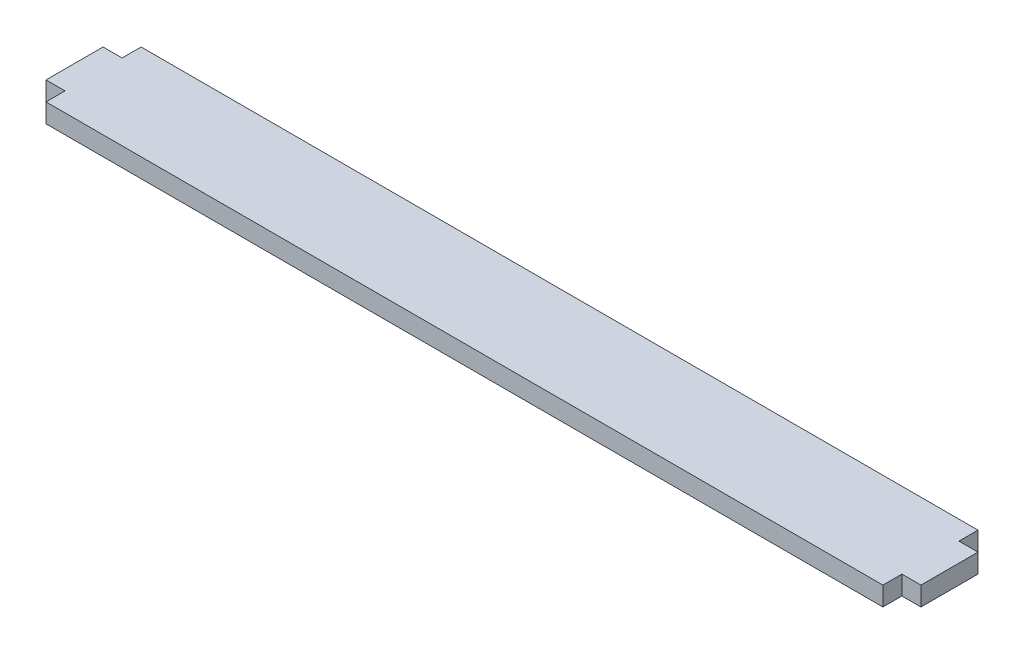
ISO-10303-21;
HEADER;
FILE_DESCRIPTION(('STEP AP214'),'2;1');
FILE_NAME('part.step','',(''),(''),'','','');
FILE_SCHEMA(('AUTOMOTIVE_DESIGN { 1 0 10303 214 1 1 1 1 }'));
ENDSEC;
DATA;
#1=APPLICATION_CONTEXT('core data for automotive mechanical design processes');
#2=APPLICATION_PROTOCOL_DEFINITION('international standard','automotive_design',2000,#1);
#3=PRODUCT_CONTEXT('',#1,'mechanical');
#4=PRODUCT('Part','Part','',(#3));
#5=PRODUCT_RELATED_PRODUCT_CATEGORY('part','',(#4));
#6=PRODUCT_DEFINITION_FORMATION('','',#4);
#7=PRODUCT_DEFINITION_CONTEXT('part definition',#1,'design');
#8=PRODUCT_DEFINITION('design','',#6,#7);
#9=PRODUCT_DEFINITION_SHAPE('','',#8);
#10=(LENGTH_UNIT() NAMED_UNIT(*) SI_UNIT(.MILLI.,.METRE.));
#11=(NAMED_UNIT(*) PLANE_ANGLE_UNIT() SI_UNIT($,.RADIAN.));
#12=(NAMED_UNIT(*) SI_UNIT($,.STERADIAN.) SOLID_ANGLE_UNIT());
#13=UNCERTAINTY_MEASURE_WITH_UNIT(LENGTH_MEASURE(1.E-05),#10,'distance_accuracy_value','');
#14=(GEOMETRIC_REPRESENTATION_CONTEXT(3) GLOBAL_UNCERTAINTY_ASSIGNED_CONTEXT((#13)) GLOBAL_UNIT_ASSIGNED_CONTEXT((#10,
#11,#12)) REPRESENTATION_CONTEXT('',''));
#15=CARTESIAN_POINT('',(0.,0.,0.));
#16=DIRECTION('',(0.,0.,1.));
#17=DIRECTION('',(1.,0.,0.));
#18=AXIS2_PLACEMENT_3D('',#15,#16,#17);
#19=CARTESIAN_POINT('',(-69.85,3.175,4.7625));
#20=DIRECTION('',(1.,0.,0.));
#21=DIRECTION('',(0.,0.,-1.));
#22=AXIS2_PLACEMENT_3D('',#19,#20,#21);
#23=PLANE('',#22);
#24=DIRECTION('',(0.,0.,1.));
#25=VECTOR('',#24,1.);
#26=CARTESIAN_POINT('',(-69.85,0.,4.7625));
#27=LINE('',#26,#25);
#28=CARTESIAN_POINT('',(-69.85,0.,4.7625));
#29=VERTEX_POINT('',#28);
#30=CARTESIAN_POINT('',(-69.85,0.,7.9375));
#31=VERTEX_POINT('',#30);
#32=EDGE_CURVE('E159',#29,#31,#27,.T.);
#33=ORIENTED_EDGE('',*,*,#32,.T.);
#34=DIRECTION('',(0.,-1.,0.));
#35=VECTOR('',#34,1.);
#36=CARTESIAN_POINT('',(-69.85,3.175,7.9375));
#37=LINE('',#36,#35);
#38=CARTESIAN_POINT('',(-69.85,3.175,7.9375));
#39=VERTEX_POINT('',#38);
#40=EDGE_CURVE('E11',#39,#31,#37,.T.);
#41=ORIENTED_EDGE('',*,*,#40,.F.);
#42=DIRECTION('',(0.,0.,1.));
#43=VECTOR('',#42,1.);
#44=CARTESIAN_POINT('',(-69.85,3.175,4.7625));
#45=LINE('',#44,#43);
#46=CARTESIAN_POINT('',(-69.85,3.175,4.7625));
#47=VERTEX_POINT('',#46);
#48=EDGE_CURVE('E181',#47,#39,#45,.T.);
#49=ORIENTED_EDGE('',*,*,#48,.F.);
#50=DIRECTION('',(0.,-1.,0.));
#51=VECTOR('',#50,1.);
#52=CARTESIAN_POINT('',(-69.85,3.175,4.7625));
#53=LINE('',#52,#51);
#54=EDGE_CURVE('E155',#47,#29,#53,.T.);
#55=ORIENTED_EDGE('',*,*,#54,.T.);
#56=EDGE_LOOP('',(#33,#41,#49,#55));
#57=FACE_BOUND('',#56,.T.);
#58=ADVANCED_FACE('F39',(#57),#23,.F.);
#59=CARTESIAN_POINT('',(-69.85,3.175,7.9375));
#60=DIRECTION('',(0.,0.,-1.));
#61=DIRECTION('',(-1.,0.,0.));
#62=AXIS2_PLACEMENT_3D('',#59,#60,#61);
#63=PLANE('',#62);
#64=DIRECTION('',(1.,0.,0.));
#65=VECTOR('',#64,1.);
#66=CARTESIAN_POINT('',(-69.85,0.,7.9375));
#67=LINE('',#66,#65);
#68=CARTESIAN_POINT('',(69.85,0.,7.9375));
#69=VERTEX_POINT('',#68);
#70=EDGE_CURVE('E162',#31,#69,#67,.T.);
#71=ORIENTED_EDGE('',*,*,#70,.T.);
#72=DIRECTION('',(0.,-1.,0.));
#73=VECTOR('',#72,1.);
#74=CARTESIAN_POINT('',(69.85,3.175,7.9375));
#75=LINE('',#74,#73);
#76=CARTESIAN_POINT('',(69.85,3.175,7.9375));
#77=VERTEX_POINT('',#76);
#78=EDGE_CURVE('E47',#77,#69,#75,.T.);
#79=ORIENTED_EDGE('',*,*,#78,.F.);
#80=DIRECTION('',(1.,0.,0.));
#81=VECTOR('',#80,1.);
#82=CARTESIAN_POINT('',(-69.85,3.175,7.9375));
#83=LINE('',#82,#81);
#84=EDGE_CURVE('E110',#39,#77,#83,.T.);
#85=ORIENTED_EDGE('',*,*,#84,.F.);
#86=ORIENTED_EDGE('',*,*,#40,.T.);
#87=EDGE_LOOP('',(#71,#79,#85,#86));
#88=FACE_BOUND('',#87,.T.);
#89=ADVANCED_FACE('F259',(#88),#63,.F.);
#90=CARTESIAN_POINT('',(69.85,3.175,7.9375));
#91=DIRECTION('',(-1.,0.,0.));
#92=DIRECTION('',(0.,0.,1.));
#93=AXIS2_PLACEMENT_3D('',#90,#91,#92);
#94=PLANE('',#93);
#95=DIRECTION('',(0.,0.,-1.));
#96=VECTOR('',#95,1.);
#97=CARTESIAN_POINT('',(69.85,0.,7.9375));
#98=LINE('',#97,#96);
#99=CARTESIAN_POINT('',(69.85,0.,4.7625));
#100=VERTEX_POINT('',#99);
#101=EDGE_CURVE('E164',#69,#100,#98,.T.);
#102=ORIENTED_EDGE('',*,*,#101,.T.);
#103=DIRECTION('',(0.,-1.,0.));
#104=VECTOR('',#103,1.);
#105=CARTESIAN_POINT('',(69.85,3.175,4.7625));
#106=LINE('',#105,#104);
#107=CARTESIAN_POINT('',(69.85,3.175,4.7625));
#108=VERTEX_POINT('',#107);
#109=EDGE_CURVE('E200',#108,#100,#106,.T.);
#110=ORIENTED_EDGE('',*,*,#109,.F.);
#111=DIRECTION('',(0.,0.,-1.));
#112=VECTOR('',#111,1.);
#113=CARTESIAN_POINT('',(69.85,3.175,7.9375));
#114=LINE('',#113,#112);
#115=EDGE_CURVE('E208',#77,#108,#114,.T.);
#116=ORIENTED_EDGE('',*,*,#115,.F.);
#117=ORIENTED_EDGE('',*,*,#78,.T.);
#118=EDGE_LOOP('',(#102,#110,#116,#117));
#119=FACE_BOUND('',#118,.T.);
#120=ADVANCED_FACE('F206',(#119),#94,.F.);
#121=CARTESIAN_POINT('',(69.85,3.175,4.7625));
#122=DIRECTION('',(0.,0.,-1.));
#123=DIRECTION('',(-1.,0.,0.));
#124=AXIS2_PLACEMENT_3D('',#121,#122,#123);
#125=PLANE('',#124);
#126=DIRECTION('',(1.,0.,0.));
#127=VECTOR('',#126,1.);
#128=CARTESIAN_POINT('',(69.85,0.,4.7625));
#129=LINE('',#128,#127);
#130=CARTESIAN_POINT('',(73.025,0.,4.7625));
#131=VERTEX_POINT('',#130);
#132=EDGE_CURVE('E166',#100,#131,#129,.T.);
#133=ORIENTED_EDGE('',*,*,#132,.T.);
#134=DIRECTION('',(0.,-1.,0.));
#135=VECTOR('',#134,1.);
#136=CARTESIAN_POINT('',(73.025,3.175,4.7625));
#137=LINE('',#136,#135);
#138=CARTESIAN_POINT('',(73.025,3.175,4.7625));
#139=VERTEX_POINT('',#138);
#140=EDGE_CURVE('E197',#139,#131,#137,.T.);
#141=ORIENTED_EDGE('',*,*,#140,.F.);
#142=DIRECTION('',(1.,0.,0.));
#143=VECTOR('',#142,1.);
#144=CARTESIAN_POINT('',(69.85,3.175,4.7625));
#145=LINE('',#144,#143);
#146=EDGE_CURVE('E226',#108,#139,#145,.T.);
#147=ORIENTED_EDGE('',*,*,#146,.F.);
#148=ORIENTED_EDGE('',*,*,#109,.T.);
#149=EDGE_LOOP('',(#133,#141,#147,#148));
#150=FACE_BOUND('',#149,.T.);
#151=ADVANCED_FACE('F217',(#150),#125,.F.);
#152=CARTESIAN_POINT('',(73.025,3.175,4.7625));
#153=DIRECTION('',(-1.,0.,0.));
#154=DIRECTION('',(0.,0.,1.));
#155=AXIS2_PLACEMENT_3D('',#152,#153,#154);
#156=PLANE('',#155);
#157=DIRECTION('',(0.,0.,-1.));
#158=VECTOR('',#157,1.);
#159=CARTESIAN_POINT('',(73.025,0.,4.7625));
#160=LINE('',#159,#158);
#161=CARTESIAN_POINT('',(73.025,0.,-4.7625));
#162=VERTEX_POINT('',#161);
#163=EDGE_CURVE('E168',#131,#162,#160,.T.);
#164=ORIENTED_EDGE('',*,*,#163,.T.);
#165=DIRECTION('',(0.,-1.,0.));
#166=VECTOR('',#165,1.);
#167=CARTESIAN_POINT('',(73.025,3.175,-4.7625));
#168=LINE('',#167,#166);
#169=CARTESIAN_POINT('',(73.025,3.175,-4.7625));
#170=VERTEX_POINT('',#169);
#171=EDGE_CURVE('E194',#170,#162,#168,.T.);
#172=ORIENTED_EDGE('',*,*,#171,.F.);
#173=DIRECTION('',(0.,0.,-1.));
#174=VECTOR('',#173,1.);
#175=CARTESIAN_POINT('',(73.025,3.175,4.7625));
#176=LINE('',#175,#174);
#177=EDGE_CURVE('E223',#139,#170,#176,.T.);
#178=ORIENTED_EDGE('',*,*,#177,.F.);
#179=ORIENTED_EDGE('',*,*,#140,.T.);
#180=EDGE_LOOP('',(#164,#172,#178,#179));
#181=FACE_BOUND('',#180,.T.);
#182=ADVANCED_FACE('F221',(#181),#156,.F.);
#183=CARTESIAN_POINT('',(73.025,3.175,-4.7625));
#184=DIRECTION('',(0.,0.,1.));
#185=DIRECTION('',(1.,0.,0.));
#186=AXIS2_PLACEMENT_3D('',#183,#184,#185);
#187=PLANE('',#186);
#188=DIRECTION('',(-1.,0.,0.));
#189=VECTOR('',#188,1.);
#190=CARTESIAN_POINT('',(73.025,0.,-4.7625));
#191=LINE('',#190,#189);
#192=CARTESIAN_POINT('',(69.85,0.,-4.7625));
#193=VERTEX_POINT('',#192);
#194=EDGE_CURVE('E170',#162,#193,#191,.T.);
#195=ORIENTED_EDGE('',*,*,#194,.T.);
#196=DIRECTION('',(0.,-1.,0.));
#197=VECTOR('',#196,1.);
#198=CARTESIAN_POINT('',(69.85,3.175,-4.7625));
#199=LINE('',#198,#197);
#200=CARTESIAN_POINT('',(69.85,3.175,-4.7625));
#201=VERTEX_POINT('',#200);
#202=EDGE_CURVE('E191',#201,#193,#199,.T.);
#203=ORIENTED_EDGE('',*,*,#202,.F.);
#204=DIRECTION('',(-1.,0.,0.));
#205=VECTOR('',#204,1.);
#206=CARTESIAN_POINT('',(73.025,3.175,-4.7625));
#207=LINE('',#206,#205);
#208=EDGE_CURVE('E225',#170,#201,#207,.T.);
#209=ORIENTED_EDGE('',*,*,#208,.F.);
#210=ORIENTED_EDGE('',*,*,#171,.T.);
#211=EDGE_LOOP('',(#195,#203,#209,#210));
#212=FACE_BOUND('',#211,.T.);
#213=ADVANCED_FACE('F272',(#212),#187,.F.);
#214=CARTESIAN_POINT('',(69.85,3.175,-4.7625));
#215=DIRECTION('',(-1.,0.,0.));
#216=DIRECTION('',(0.,0.,1.));
#217=AXIS2_PLACEMENT_3D('',#214,#215,#216);
#218=PLANE('',#217);
#219=DIRECTION('',(0.,0.,-1.));
#220=VECTOR('',#219,1.);
#221=CARTESIAN_POINT('',(69.85,0.,-4.7625));
#222=LINE('',#221,#220);
#223=CARTESIAN_POINT('',(69.85,0.,-7.9375));
#224=VERTEX_POINT('',#223);
#225=EDGE_CURVE('E172',#193,#224,#222,.T.);
#226=ORIENTED_EDGE('',*,*,#225,.T.);
#227=DIRECTION('',(0.,-1.,0.));
#228=VECTOR('',#227,1.);
#229=CARTESIAN_POINT('',(69.85,3.175,-7.9375));
#230=LINE('',#229,#228);
#231=CARTESIAN_POINT('',(69.85,3.175,-7.9375));
#232=VERTEX_POINT('',#231);
#233=EDGE_CURVE('E188',#232,#224,#230,.T.);
#234=ORIENTED_EDGE('',*,*,#233,.F.);
#235=DIRECTION('',(0.,0.,-1.));
#236=VECTOR('',#235,1.);
#237=CARTESIAN_POINT('',(69.85,3.175,-4.7625));
#238=LINE('',#237,#236);
#239=EDGE_CURVE('E228',#201,#232,#238,.T.);
#240=ORIENTED_EDGE('',*,*,#239,.F.);
#241=ORIENTED_EDGE('',*,*,#202,.T.);
#242=EDGE_LOOP('',(#226,#234,#240,#241));
#243=FACE_BOUND('',#242,.T.);
#244=ADVANCED_FACE('F275',(#243),#218,.F.);
#245=CARTESIAN_POINT('',(69.85,3.175,-7.9375));
#246=DIRECTION('',(0.,0.,1.));
#247=DIRECTION('',(1.,0.,0.));
#248=AXIS2_PLACEMENT_3D('',#245,#246,#247);
#249=PLANE('',#248);
#250=DIRECTION('',(-1.,0.,0.));
#251=VECTOR('',#250,1.);
#252=CARTESIAN_POINT('',(69.85,0.,-7.9375));
#253=LINE('',#252,#251);
#254=CARTESIAN_POINT('',(-69.85,0.,-7.9375));
#255=VERTEX_POINT('',#254);
#256=EDGE_CURVE('E174',#224,#255,#253,.T.);
#257=ORIENTED_EDGE('',*,*,#256,.T.);
#258=DIRECTION('',(0.,-1.,0.));
#259=VECTOR('',#258,1.);
#260=CARTESIAN_POINT('',(-69.85,3.175,-7.9375));
#261=LINE('',#260,#259);
#262=CARTESIAN_POINT('',(-69.85,3.175,-7.9375));
#263=VERTEX_POINT('',#262);
#264=EDGE_CURVE('E185',#263,#255,#261,.T.);
#265=ORIENTED_EDGE('',*,*,#264,.F.);
#266=DIRECTION('',(-1.,0.,0.));
#267=VECTOR('',#266,1.);
#268=CARTESIAN_POINT('',(69.85,3.175,-7.9375));
#269=LINE('',#268,#267);
#270=EDGE_CURVE('E234',#232,#263,#269,.T.);
#271=ORIENTED_EDGE('',*,*,#270,.F.);
#272=ORIENTED_EDGE('',*,*,#233,.T.);
#273=EDGE_LOOP('',(#257,#265,#271,#272));
#274=FACE_BOUND('',#273,.T.);
#275=ADVANCED_FACE('F240',(#274),#249,.F.);
#276=CARTESIAN_POINT('',(-69.85,3.175,-7.9375));
#277=DIRECTION('',(1.,0.,0.));
#278=DIRECTION('',(0.,0.,-1.));
#279=AXIS2_PLACEMENT_3D('',#276,#277,#278);
#280=PLANE('',#279);
#281=DIRECTION('',(0.,0.,1.));
#282=VECTOR('',#281,1.);
#283=CARTESIAN_POINT('',(-69.85,0.,-7.9375));
#284=LINE('',#283,#282);
#285=CARTESIAN_POINT('',(-69.85,0.,-4.7625));
#286=VERTEX_POINT('',#285);
#287=EDGE_CURVE('E176',#255,#286,#284,.T.);
#288=ORIENTED_EDGE('',*,*,#287,.T.);
#289=DIRECTION('',(0.,-1.,0.));
#290=VECTOR('',#289,1.);
#291=CARTESIAN_POINT('',(-69.85,3.175,-4.7625));
#292=LINE('',#291,#290);
#293=CARTESIAN_POINT('',(-69.85,3.175,-4.7625));
#294=VERTEX_POINT('',#293);
#295=EDGE_CURVE('E150',#294,#286,#292,.T.);
#296=ORIENTED_EDGE('',*,*,#295,.F.);
#297=DIRECTION('',(0.,0.,1.));
#298=VECTOR('',#297,1.);
#299=CARTESIAN_POINT('',(-69.85,3.175,-7.9375));
#300=LINE('',#299,#298);
#301=EDGE_CURVE('E141',#263,#294,#300,.T.);
#302=ORIENTED_EDGE('',*,*,#301,.F.);
#303=ORIENTED_EDGE('',*,*,#264,.T.);
#304=EDGE_LOOP('',(#288,#296,#302,#303));
#305=FACE_BOUND('',#304,.T.);
#306=ADVANCED_FACE('F244',(#305),#280,.F.);
#307=CARTESIAN_POINT('',(-69.85,3.175,-4.7625));
#308=DIRECTION('',(0.,0.,1.));
#309=DIRECTION('',(1.,0.,0.));
#310=AXIS2_PLACEMENT_3D('',#307,#308,#309);
#311=PLANE('',#310);
#312=DIRECTION('',(-1.,0.,0.));
#313=VECTOR('',#312,1.);
#314=CARTESIAN_POINT('',(-69.85,0.,-4.7625));
#315=LINE('',#314,#313);
#316=CARTESIAN_POINT('',(-73.025,0.,-4.7625));
#317=VERTEX_POINT('',#316);
#318=EDGE_CURVE('E149',#286,#317,#315,.T.);
#319=ORIENTED_EDGE('',*,*,#318,.T.);
#320=DIRECTION('',(0.,-1.,0.));
#321=VECTOR('',#320,1.);
#322=CARTESIAN_POINT('',(-73.025,3.175,-4.7625));
#323=LINE('',#322,#321);
#324=CARTESIAN_POINT('',(-73.025,3.175,-4.7625));
#325=VERTEX_POINT('',#324);
#326=EDGE_CURVE('E146',#325,#317,#323,.T.);
#327=ORIENTED_EDGE('',*,*,#326,.F.);
#328=DIRECTION('',(-1.,0.,0.));
#329=VECTOR('',#328,1.);
#330=CARTESIAN_POINT('',(-69.85,3.175,-4.7625));
#331=LINE('',#330,#329);
#332=EDGE_CURVE('E135',#294,#325,#331,.T.);
#333=ORIENTED_EDGE('',*,*,#332,.F.);
#334=ORIENTED_EDGE('',*,*,#295,.T.);
#335=EDGE_LOOP('',(#319,#327,#333,#334));
#336=FACE_BOUND('',#335,.T.);
#337=ADVANCED_FACE('F147',(#336),#311,.F.);
#338=CARTESIAN_POINT('',(-73.025,3.175,-4.7625));
#339=DIRECTION('',(1.,0.,0.));
#340=DIRECTION('',(0.,0.,-1.));
#341=AXIS2_PLACEMENT_3D('',#338,#339,#340);
#342=PLANE('',#341);
#343=DIRECTION('',(0.,0.,1.));
#344=VECTOR('',#343,1.);
#345=CARTESIAN_POINT('',(-73.025,0.,-4.7625));
#346=LINE('',#345,#344);
#347=CARTESIAN_POINT('',(-73.025,0.,4.7625));
#348=VERTEX_POINT('',#347);
#349=EDGE_CURVE('E96',#317,#348,#346,.T.);
#350=ORIENTED_EDGE('',*,*,#349,.T.);
#351=DIRECTION('',(0.,-1.,0.));
#352=VECTOR('',#351,1.);
#353=CARTESIAN_POINT('',(-73.025,3.175,4.7625));
#354=LINE('',#353,#352);
#355=CARTESIAN_POINT('',(-73.025,3.175,4.7625));
#356=VERTEX_POINT('',#355);
#357=EDGE_CURVE('E151',#356,#348,#354,.T.);
#358=ORIENTED_EDGE('',*,*,#357,.F.);
#359=DIRECTION('',(0.,0.,1.));
#360=VECTOR('',#359,1.);
#361=CARTESIAN_POINT('',(-73.025,3.175,-4.7625));
#362=LINE('',#361,#360);
#363=EDGE_CURVE('E139',#325,#356,#362,.T.);
#364=ORIENTED_EDGE('',*,*,#363,.F.);
#365=ORIENTED_EDGE('',*,*,#326,.T.);
#366=EDGE_LOOP('',(#350,#358,#364,#365));
#367=FACE_BOUND('',#366,.T.);
#368=ADVANCED_FACE('F153',(#367),#342,.F.);
#369=CARTESIAN_POINT('',(-73.025,3.175,4.7625));
#370=DIRECTION('',(0.,0.,-1.));
#371=DIRECTION('',(-1.,0.,0.));
#372=AXIS2_PLACEMENT_3D('',#369,#370,#371);
#373=PLANE('',#372);
#374=DIRECTION('',(1.,0.,0.));
#375=VECTOR('',#374,1.);
#376=CARTESIAN_POINT('',(-73.025,0.,4.7625));
#377=LINE('',#376,#375);
#378=EDGE_CURVE('E102',#348,#29,#377,.T.);
#379=ORIENTED_EDGE('',*,*,#378,.T.);
#380=ORIENTED_EDGE('',*,*,#54,.F.);
#381=DIRECTION('',(1.,0.,0.));
#382=VECTOR('',#381,1.);
#383=CARTESIAN_POINT('',(-73.025,3.175,4.7625));
#384=LINE('',#383,#382);
#385=EDGE_CURVE('E55',#356,#47,#384,.T.);
#386=ORIENTED_EDGE('',*,*,#385,.F.);
#387=ORIENTED_EDGE('',*,*,#357,.T.);
#388=EDGE_LOOP('',(#379,#380,#386,#387));
#389=FACE_BOUND('',#388,.T.);
#390=ADVANCED_FACE('F248',(#389),#373,.F.);
#391=CARTESIAN_POINT('',(0.,3.175,0.));
#392=DIRECTION('',(0.,1.,0.));
#393=DIRECTION('',(0.,0.,1.));
#394=AXIS2_PLACEMENT_3D('',#391,#392,#393);
#395=PLANE('',#394);
#396=ORIENTED_EDGE('',*,*,#48,.T.);
#397=ORIENTED_EDGE('',*,*,#84,.T.);
#398=ORIENTED_EDGE('',*,*,#115,.T.);
#399=ORIENTED_EDGE('',*,*,#146,.T.);
#400=ORIENTED_EDGE('',*,*,#177,.T.);
#401=ORIENTED_EDGE('',*,*,#208,.T.);
#402=ORIENTED_EDGE('',*,*,#239,.T.);
#403=ORIENTED_EDGE('',*,*,#270,.T.);
#404=ORIENTED_EDGE('',*,*,#301,.T.);
#405=ORIENTED_EDGE('',*,*,#332,.T.);
#406=ORIENTED_EDGE('',*,*,#363,.T.);
#407=ORIENTED_EDGE('',*,*,#385,.T.);
#408=EDGE_LOOP('',(#396,#397,#398,#399,#400,#401,#402,#403,#404,#405,#406,#407));
#409=FACE_BOUND('',#408,.T.);
#410=ADVANCED_FACE('F137',(#409),#395,.T.);
#411=CARTESIAN_POINT('',(0.,0.,0.));
#412=DIRECTION('',(0.,1.,0.));
#413=DIRECTION('',(0.,0.,1.));
#414=AXIS2_PLACEMENT_3D('',#411,#412,#413);
#415=PLANE('',#414);
#416=ORIENTED_EDGE('',*,*,#32,.F.);
#417=ORIENTED_EDGE('',*,*,#378,.F.);
#418=ORIENTED_EDGE('',*,*,#349,.F.);
#419=ORIENTED_EDGE('',*,*,#318,.F.);
#420=ORIENTED_EDGE('',*,*,#287,.F.);
#421=ORIENTED_EDGE('',*,*,#256,.F.);
#422=ORIENTED_EDGE('',*,*,#225,.F.);
#423=ORIENTED_EDGE('',*,*,#194,.F.);
#424=ORIENTED_EDGE('',*,*,#163,.F.);
#425=ORIENTED_EDGE('',*,*,#132,.F.);
#426=ORIENTED_EDGE('',*,*,#101,.F.);
#427=ORIENTED_EDGE('',*,*,#70,.F.);
#428=EDGE_LOOP('',(#416,#417,#418,#419,#420,#421,#422,#423,#424,#425,#426,#427));
#429=FACE_BOUND('',#428,.T.);
#430=ADVANCED_FACE('F212',(#429),#415,.F.);
#431=CLOSED_SHELL('',(#58,#89,#120,#151,#182,#213,#244,#275,#306,#337,#368,#390,#410,#430));
#432=MANIFOLD_SOLID_BREP('B2',#431);
#433=ADVANCED_BREP_SHAPE_REPRESENTATION('',(#18,#432),#14);
#434=SHAPE_DEFINITION_REPRESENTATION(#9,#433);
ENDSEC;
END-ISO-10303-21;
